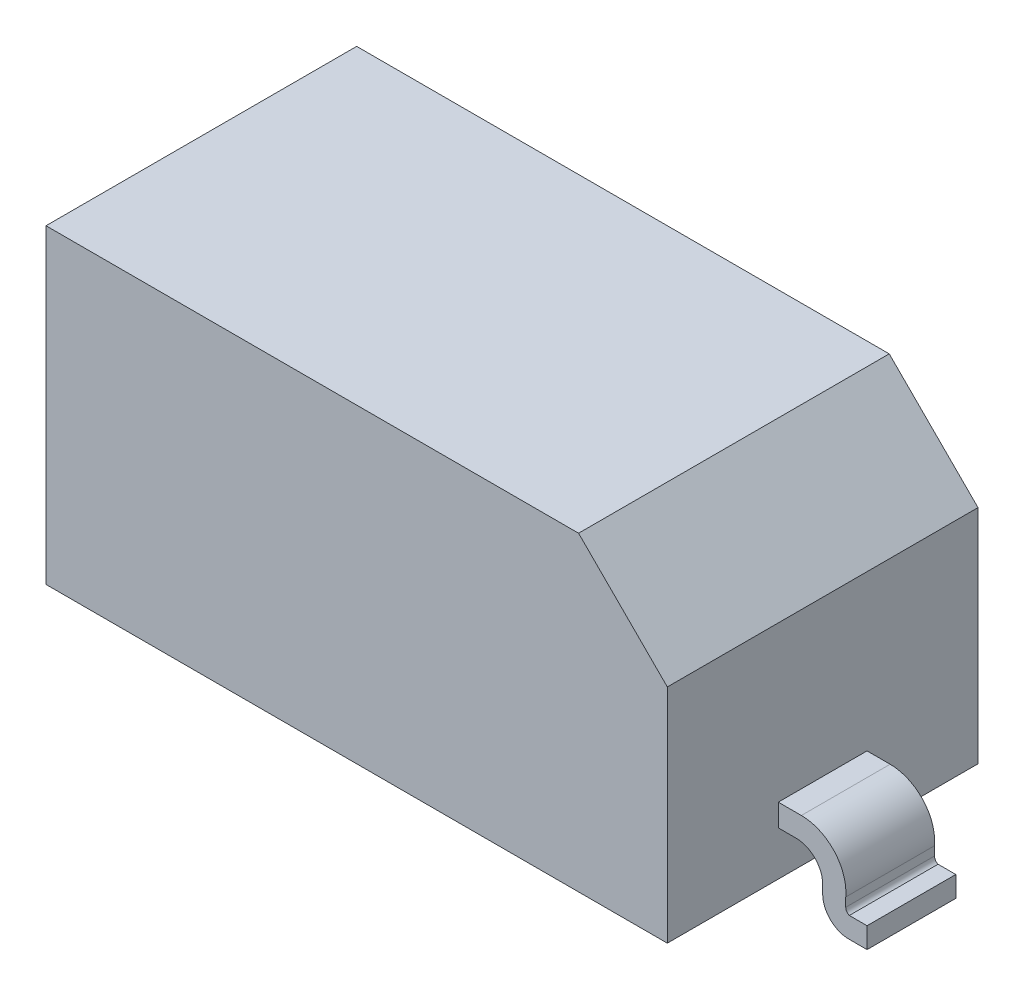
ISO-10303-21;
HEADER;
FILE_DESCRIPTION(('STEP AP214'),'2;1');
FILE_NAME('part.step','',(''),(''),'','','');
FILE_SCHEMA(('AUTOMOTIVE_DESIGN { 1 0 10303 214 1 1 1 1 }'));
ENDSEC;
DATA;
#1=APPLICATION_CONTEXT('core data for automotive mechanical design processes');
#2=APPLICATION_PROTOCOL_DEFINITION('international standard','automotive_design',2000,#1);
#3=PRODUCT_CONTEXT('',#1,'mechanical');
#4=PRODUCT('Part','Part','',(#3));
#5=PRODUCT_RELATED_PRODUCT_CATEGORY('part','',(#4));
#6=PRODUCT_DEFINITION_FORMATION('','',#4);
#7=PRODUCT_DEFINITION_CONTEXT('part definition',#1,'design');
#8=PRODUCT_DEFINITION('design','',#6,#7);
#9=PRODUCT_DEFINITION_SHAPE('','',#8);
#10=(LENGTH_UNIT() NAMED_UNIT(*) SI_UNIT(.MILLI.,.METRE.));
#11=(NAMED_UNIT(*) PLANE_ANGLE_UNIT() SI_UNIT($,.RADIAN.));
#12=(NAMED_UNIT(*) SI_UNIT($,.STERADIAN.) SOLID_ANGLE_UNIT());
#13=UNCERTAINTY_MEASURE_WITH_UNIT(LENGTH_MEASURE(1.E-05),#10,'distance_accuracy_value','');
#14=(GEOMETRIC_REPRESENTATION_CONTEXT(3) GLOBAL_UNCERTAINTY_ASSIGNED_CONTEXT((#13)) GLOBAL_UNIT_ASSIGNED_CONTEXT((#10,
#11,#12)) REPRESENTATION_CONTEXT('',''));
#15=CARTESIAN_POINT('',(0.,0.,0.));
#16=DIRECTION('',(0.,0.,1.));
#17=DIRECTION('',(1.,0.,0.));
#18=AXIS2_PLACEMENT_3D('',#15,#16,#17);
#19=CARTESIAN_POINT('',(-1.75,0.875,0.875));
#20=DIRECTION('',(1.,0.,0.));
#21=DIRECTION('',(0.,0.,-1.));
#22=AXIS2_PLACEMENT_3D('',#19,#20,#21);
#23=PLANE('',#22);
#24=DIRECTION('',(0.,-1.,0.));
#25=VECTOR('',#24,1.);
#26=CARTESIAN_POINT('',(-1.75,0.875,-0.875));
#27=LINE('',#26,#25);
#28=CARTESIAN_POINT('',(-1.75,0.875,-0.875));
#29=VERTEX_POINT('',#28);
#30=CARTESIAN_POINT('',(-1.75,-0.875,-0.875));
#31=VERTEX_POINT('',#30);
#32=EDGE_CURVE('E338',#29,#31,#27,.T.);
#33=ORIENTED_EDGE('',*,*,#32,.T.);
#34=DIRECTION('',(0.,0.,-1.));
#35=VECTOR('',#34,1.);
#36=CARTESIAN_POINT('',(-1.75,-0.875,0.875));
#37=LINE('',#36,#35);
#38=CARTESIAN_POINT('',(-1.75,-0.875,0.875));
#39=VERTEX_POINT('',#38);
#40=EDGE_CURVE('E11',#39,#31,#37,.T.);
#41=ORIENTED_EDGE('',*,*,#40,.F.);
#42=DIRECTION('',(0.,-1.,0.));
#43=VECTOR('',#42,1.);
#44=CARTESIAN_POINT('',(-1.75,0.875,0.875));
#45=LINE('',#44,#43);
#46=CARTESIAN_POINT('',(-1.75,0.875,0.875));
#47=VERTEX_POINT('',#46);
#48=EDGE_CURVE('E339',#47,#39,#45,.T.);
#49=ORIENTED_EDGE('',*,*,#48,.F.);
#50=DIRECTION('',(0.,0.,-1.));
#51=VECTOR('',#50,1.);
#52=CARTESIAN_POINT('',(-1.75,0.875,0.875));
#53=LINE('',#52,#51);
#54=EDGE_CURVE('E351',#47,#29,#53,.T.);
#55=ORIENTED_EDGE('',*,*,#54,.T.);
#56=EDGE_LOOP('',(#33,#41,#49,#55));
#57=FACE_BOUND('',#56,.T.);
#58=DIRECTION('',(0.,-1.,0.));
#59=VECTOR('',#58,1.);
#60=CARTESIAN_POINT('',(-1.75,-0.625,0.25));
#61=LINE('',#60,#59);
#62=CARTESIAN_POINT('',(-1.75,-0.49948491419278,0.25));
#63=VERTEX_POINT('',#62);
#64=CARTESIAN_POINT('',(-1.75,-0.625,0.25));
#65=VERTEX_POINT('',#64);
#66=EDGE_CURVE('E227',#63,#65,#61,.T.);
#67=ORIENTED_EDGE('',*,*,#66,.T.);
#68=DIRECTION('',(0.,0.,-1.));
#69=VECTOR('',#68,1.);
#70=CARTESIAN_POINT('',(-1.75,-0.625,0.25));
#71=LINE('',#70,#69);
#72=CARTESIAN_POINT('',(-1.75,-0.625,-0.25));
#73=VERTEX_POINT('',#72);
#74=EDGE_CURVE('E708',#65,#73,#71,.T.);
#75=ORIENTED_EDGE('',*,*,#74,.T.);
#76=DIRECTION('',(0.,-1.,0.));
#77=VECTOR('',#76,1.);
#78=CARTESIAN_POINT('',(-1.75,-0.625,-0.25));
#79=LINE('',#78,#77);
#80=CARTESIAN_POINT('',(-1.75,-0.499484914192779,-0.25));
#81=VERTEX_POINT('',#80);
#82=EDGE_CURVE('E248',#81,#73,#79,.T.);
#83=ORIENTED_EDGE('',*,*,#82,.F.);
#84=DIRECTION('',(0.,0.,-1.));
#85=VECTOR('',#84,1.);
#86=CARTESIAN_POINT('',(-1.75,-0.49948491419278,0.25));
#87=LINE('',#86,#85);
#88=EDGE_CURVE('E243',#63,#81,#87,.T.);
#89=ORIENTED_EDGE('',*,*,#88,.F.);
#90=EDGE_LOOP('',(#67,#75,#83,#89));
#91=FACE_BOUND('',#90,.T.);
#92=ADVANCED_FACE('F35',(#57,#91),#23,.F.);
#93=CARTESIAN_POINT('',(1.75,-0.874999999999999,0.875));
#94=DIRECTION('',(-1.,0.,0.));
#95=DIRECTION('',(0.,-1.,0.));
#96=AXIS2_PLACEMENT_3D('',#93,#94,#95);
#97=PLANE('',#96);
#98=DIRECTION('',(0.,1.,0.));
#99=VECTOR('',#98,1.);
#100=CARTESIAN_POINT('',(1.75,-0.874999999999999,-0.875));
#101=LINE('',#100,#99);
#102=CARTESIAN_POINT('',(1.75,-0.874999999999999,-0.875));
#103=VERTEX_POINT('',#102);
#104=CARTESIAN_POINT('',(1.75,0.375000000000001,-0.875));
#105=VERTEX_POINT('',#104);
#106=EDGE_CURVE('E356',#103,#105,#101,.T.);
#107=ORIENTED_EDGE('',*,*,#106,.T.);
#108=DIRECTION('',(0.,0.,-1.));
#109=VECTOR('',#108,1.);
#110=CARTESIAN_POINT('',(1.75,0.375000000000001,0.875));
#111=LINE('',#110,#109);
#112=CARTESIAN_POINT('',(1.75,0.375000000000001,0.875));
#113=VERTEX_POINT('',#112);
#114=EDGE_CURVE('E366',#113,#105,#111,.T.);
#115=ORIENTED_EDGE('',*,*,#114,.F.);
#116=DIRECTION('',(0.,1.,0.));
#117=VECTOR('',#116,1.);
#118=CARTESIAN_POINT('',(1.75,-0.874999999999999,0.875));
#119=LINE('',#118,#117);
#120=CARTESIAN_POINT('',(1.75,-0.874999999999999,0.875));
#121=VERTEX_POINT('',#120);
#122=EDGE_CURVE('E345',#121,#113,#119,.T.);
#123=ORIENTED_EDGE('',*,*,#122,.F.);
#124=DIRECTION('',(0.,0.,-1.));
#125=VECTOR('',#124,1.);
#126=CARTESIAN_POINT('',(1.75,-0.874999999999999,0.875));
#127=LINE('',#126,#125);
#128=EDGE_CURVE('E42',#121,#103,#127,.T.);
#129=ORIENTED_EDGE('',*,*,#128,.T.);
#130=EDGE_LOOP('',(#107,#115,#123,#129));
#131=FACE_BOUND('',#130,.T.);
#132=DIRECTION('',(0.,-1.,0.));
#133=VECTOR('',#132,1.);
#134=CARTESIAN_POINT('',(1.75,-0.625,0.25));
#135=LINE('',#134,#133);
#136=CARTESIAN_POINT('',(1.75,-0.49948491419278,0.25));
#137=VERTEX_POINT('',#136);
#138=CARTESIAN_POINT('',(1.75,-0.625,0.25));
#139=VERTEX_POINT('',#138);
#140=EDGE_CURVE('E258',#137,#139,#135,.T.);
#141=ORIENTED_EDGE('',*,*,#140,.F.);
#142=DIRECTION('',(0.,0.,-1.));
#143=VECTOR('',#142,1.);
#144=CARTESIAN_POINT('',(1.75,-0.49948491419278,0.25));
#145=LINE('',#144,#143);
#146=CARTESIAN_POINT('',(1.75,-0.49948491419278,-0.25));
#147=VERTEX_POINT('',#146);
#148=EDGE_CURVE('E283',#137,#147,#145,.T.);
#149=ORIENTED_EDGE('',*,*,#148,.T.);
#150=DIRECTION('',(0.,-1.,0.));
#151=VECTOR('',#150,1.);
#152=CARTESIAN_POINT('',(1.75,-0.625,-0.25));
#153=LINE('',#152,#151);
#154=CARTESIAN_POINT('',(1.75,-0.625,-0.25));
#155=VERTEX_POINT('',#154);
#156=EDGE_CURVE('E249',#147,#155,#153,.T.);
#157=ORIENTED_EDGE('',*,*,#156,.T.);
#158=DIRECTION('',(0.,0.,-1.));
#159=VECTOR('',#158,1.);
#160=CARTESIAN_POINT('',(1.75,-0.625,0.25));
#161=LINE('',#160,#159);
#162=EDGE_CURVE('E57',#139,#155,#161,.T.);
#163=ORIENTED_EDGE('',*,*,#162,.F.);
#164=EDGE_LOOP('',(#141,#149,#157,#163));
#165=FACE_BOUND('',#164,.T.);
#166=ADVANCED_FACE('F373',(#131,#165),#97,.F.);
#167=CARTESIAN_POINT('',(-1.75,-0.875,0.875));
#168=DIRECTION('',(0.,1.,0.));
#169=DIRECTION('',(-1.,0.,0.));
#170=AXIS2_PLACEMENT_3D('',#167,#168,#169);
#171=PLANE('',#170);
#172=DIRECTION('',(1.,0.,0.));
#173=VECTOR('',#172,1.);
#174=CARTESIAN_POINT('',(-1.75,-0.875,-0.875));
#175=LINE('',#174,#173);
#176=EDGE_CURVE('E354',#31,#103,#175,.T.);
#177=ORIENTED_EDGE('',*,*,#176,.T.);
#178=ORIENTED_EDGE('',*,*,#128,.F.);
#179=DIRECTION('',(1.,0.,0.));
#180=VECTOR('',#179,1.);
#181=CARTESIAN_POINT('',(-1.75,-0.875,0.875));
#182=LINE('',#181,#180);
#183=EDGE_CURVE('E342',#39,#121,#182,.T.);
#184=ORIENTED_EDGE('',*,*,#183,.F.);
#185=ORIENTED_EDGE('',*,*,#40,.T.);
#186=EDGE_LOOP('',(#177,#178,#184,#185));
#187=FACE_BOUND('',#186,.T.);
#188=ADVANCED_FACE('F394',(#187),#171,.F.);
#189=CARTESIAN_POINT('',(1.75,0.375000000000001,0.875));
#190=DIRECTION('',(-0.707106781186548,-0.707106781186547,0.));
#191=DIRECTION('',(0.707106781186547,-0.707106781186548,0.));
#192=AXIS2_PLACEMENT_3D('',#189,#190,#191);
#193=PLANE('',#192);
#194=DIRECTION('',(-0.707106781186547,0.707106781186548,0.));
#195=VECTOR('',#194,1.);
#196=CARTESIAN_POINT('',(1.75,0.375000000000001,-0.875));
#197=LINE('',#196,#195);
#198=CARTESIAN_POINT('',(1.25,0.875,-0.875));
#199=VERTEX_POINT('',#198);
#200=EDGE_CURVE('E358',#105,#199,#197,.T.);
#201=ORIENTED_EDGE('',*,*,#200,.T.);
#202=DIRECTION('',(0.,0.,-1.));
#203=VECTOR('',#202,1.);
#204=CARTESIAN_POINT('',(1.25,0.875,0.875));
#205=LINE('',#204,#203);
#206=CARTESIAN_POINT('',(1.25,0.875,0.875));
#207=VERTEX_POINT('',#206);
#208=EDGE_CURVE('E363',#207,#199,#205,.T.);
#209=ORIENTED_EDGE('',*,*,#208,.F.);
#210=DIRECTION('',(-0.707106781186547,0.707106781186548,0.));
#211=VECTOR('',#210,1.);
#212=CARTESIAN_POINT('',(1.75,0.375000000000001,0.875));
#213=LINE('',#212,#211);
#214=EDGE_CURVE('E347',#113,#207,#213,.T.);
#215=ORIENTED_EDGE('',*,*,#214,.F.);
#216=ORIENTED_EDGE('',*,*,#114,.T.);
#217=EDGE_LOOP('',(#201,#209,#215,#216));
#218=FACE_BOUND('',#217,.T.);
#219=ADVANCED_FACE('F384',(#218),#193,.F.);
#220=CARTESIAN_POINT('',(1.25,0.875,0.875));
#221=DIRECTION('',(0.,-1.,0.));
#222=DIRECTION('',(0.,0.,-1.));
#223=AXIS2_PLACEMENT_3D('',#220,#221,#222);
#224=PLANE('',#223);
#225=DIRECTION('',(-1.,0.,0.));
#226=VECTOR('',#225,1.);
#227=CARTESIAN_POINT('',(1.25,0.875,-0.875));
#228=LINE('',#227,#226);
#229=EDGE_CURVE('E343',#199,#29,#228,.T.);
#230=ORIENTED_EDGE('',*,*,#229,.T.);
#231=ORIENTED_EDGE('',*,*,#54,.F.);
#232=DIRECTION('',(-1.,0.,0.));
#233=VECTOR('',#232,1.);
#234=CARTESIAN_POINT('',(1.25,0.875,0.875));
#235=LINE('',#234,#233);
#236=EDGE_CURVE('E349',#207,#47,#235,.T.);
#237=ORIENTED_EDGE('',*,*,#236,.F.);
#238=ORIENTED_EDGE('',*,*,#208,.T.);
#239=EDGE_LOOP('',(#230,#231,#237,#238));
#240=FACE_BOUND('',#239,.T.);
#241=ADVANCED_FACE('F388',(#240),#224,.F.);
#242=CARTESIAN_POINT('',(-1.75,0.875,0.875));
#243=DIRECTION('',(0.,0.,-1.));
#244=DIRECTION('',(-1.,0.,0.));
#245=AXIS2_PLACEMENT_3D('',#242,#243,#244);
#246=PLANE('',#245);
#247=ORIENTED_EDGE('',*,*,#48,.T.);
#248=ORIENTED_EDGE('',*,*,#183,.T.);
#249=ORIENTED_EDGE('',*,*,#122,.T.);
#250=ORIENTED_EDGE('',*,*,#214,.T.);
#251=ORIENTED_EDGE('',*,*,#236,.T.);
#252=EDGE_LOOP('',(#247,#248,#249,#250,#251));
#253=FACE_BOUND('',#252,.T.);
#254=ADVANCED_FACE('F392',(#253),#246,.F.);
#255=CARTESIAN_POINT('',(-1.75,0.875,-0.875));
#256=DIRECTION('',(0.,0.,-1.));
#257=DIRECTION('',(-1.,0.,0.));
#258=AXIS2_PLACEMENT_3D('',#255,#256,#257);
#259=PLANE('',#258);
#260=ORIENTED_EDGE('',*,*,#32,.F.);
#261=ORIENTED_EDGE('',*,*,#229,.F.);
#262=ORIENTED_EDGE('',*,*,#200,.F.);
#263=ORIENTED_EDGE('',*,*,#106,.F.);
#264=ORIENTED_EDGE('',*,*,#176,.F.);
#265=EDGE_LOOP('',(#260,#261,#262,#263,#264));
#266=FACE_BOUND('',#265,.T.);
#267=ADVANCED_FACE('F380',(#266),#259,.T.);
#268=CARTESIAN_POINT('',(1.75,-0.625,0.25));
#269=DIRECTION('',(0.,1.,0.));
#270=DIRECTION('',(0.,0.,1.));
#271=AXIS2_PLACEMENT_3D('',#268,#269,#270);
#272=PLANE('',#271);
#273=DIRECTION('',(1.,0.,0.));
#274=VECTOR('',#273,1.);
#275=CARTESIAN_POINT('',(1.75,-0.625,-0.25));
#276=LINE('',#275,#274);
#277=CARTESIAN_POINT('',(1.85,-0.625,-0.25));
#278=VERTEX_POINT('',#277);
#279=EDGE_CURVE('E252',#155,#278,#276,.T.);
#280=ORIENTED_EDGE('',*,*,#279,.T.);
#281=DIRECTION('',(0.,0.,-1.));
#282=VECTOR('',#281,1.);
#283=CARTESIAN_POINT('',(1.85,-0.625,0.25));
#284=LINE('',#283,#282);
#285=CARTESIAN_POINT('',(1.85,-0.625,0.25));
#286=VERTEX_POINT('',#285);
#287=EDGE_CURVE('E334',#286,#278,#284,.T.);
#288=ORIENTED_EDGE('',*,*,#287,.F.);
#289=DIRECTION('',(1.,0.,0.));
#290=VECTOR('',#289,1.);
#291=CARTESIAN_POINT('',(1.75,-0.625,0.25));
#292=LINE('',#291,#290);
#293=EDGE_CURVE('E261',#139,#286,#292,.T.);
#294=ORIENTED_EDGE('',*,*,#293,.F.);
#295=ORIENTED_EDGE('',*,*,#162,.T.);
#296=EDGE_LOOP('',(#280,#288,#294,#295));
#297=FACE_BOUND('',#296,.T.);
#298=ADVANCED_FACE('F411',(#297),#272,.F.);
#299=CARTESIAN_POINT('',(1.85,-0.77503124674547,0.25));
#300=DIRECTION('',(0.,0.,-1.));
#301=DIRECTION('',(-1.,0.,0.));
#302=AXIS2_PLACEMENT_3D('',#299,#300,#301);
#303=CYLINDRICAL_SURFACE('',#302,0.15003124674547);
#304=CARTESIAN_POINT('',(1.85,-0.77503124674547,-0.25));
#305=DIRECTION('',(0.,0.,-1.));
#306=DIRECTION('',(-1.,0.,0.));
#307=AXIS2_PLACEMENT_3D('',#304,#305,#306);
#308=CIRCLE('',#307,0.15003124674547);
#309=CARTESIAN_POINT('',(2.,-0.771969384566991,-0.25));
#310=VERTEX_POINT('',#309);
#311=EDGE_CURVE('E286',#278,#310,#308,.T.);
#312=ORIENTED_EDGE('',*,*,#311,.T.);
#313=DIRECTION('',(0.,0.,-1.));
#314=VECTOR('',#313,1.);
#315=CARTESIAN_POINT('',(2.,-0.771969384566991,0.25));
#316=LINE('',#315,#314);
#317=CARTESIAN_POINT('',(2.,-0.771969384566991,0.25));
#318=VERTEX_POINT('',#317);
#319=EDGE_CURVE('E331',#318,#310,#316,.T.);
#320=ORIENTED_EDGE('',*,*,#319,.F.);
#321=CARTESIAN_POINT('',(1.85,-0.77503124674547,0.25));
#322=DIRECTION('',(0.,0.,-1.));
#323=DIRECTION('',(-1.,0.,0.));
#324=AXIS2_PLACEMENT_3D('',#321,#322,#323);
#325=CIRCLE('',#324,0.15003124674547);
#326=EDGE_CURVE('E264',#286,#318,#325,.T.);
#327=ORIENTED_EDGE('',*,*,#326,.F.);
#328=ORIENTED_EDGE('',*,*,#287,.T.);
#329=EDGE_LOOP('',(#312,#320,#327,#328));
#330=FACE_BOUND('',#329,.T.);
#331=ADVANCED_FACE('F416',(#330),#303,.F.);
#332=CARTESIAN_POINT('',(2.,-0.771969384566991,0.25));
#333=DIRECTION('',(1.,0.,0.));
#334=DIRECTION('',(0.,0.,-1.));
#335=AXIS2_PLACEMENT_3D('',#332,#333,#334);
#336=PLANE('',#335);
#337=DIRECTION('',(0.,-1.,0.));
#338=VECTOR('',#337,1.);
#339=CARTESIAN_POINT('',(2.,-0.771969384566991,-0.25));
#340=LINE('',#339,#338);
#341=CARTESIAN_POINT('',(2.,-0.821969384566991,-0.25));
#342=VERTEX_POINT('',#341);
#343=EDGE_CURVE('E288',#310,#342,#340,.T.);
#344=ORIENTED_EDGE('',*,*,#343,.T.);
#345=DIRECTION('',(0.,0.,-1.));
#346=VECTOR('',#345,1.);
#347=CARTESIAN_POINT('',(2.,-0.821969384566991,0.25));
#348=LINE('',#347,#346);
#349=CARTESIAN_POINT('',(2.,-0.821969384566991,0.25));
#350=VERTEX_POINT('',#349);
#351=EDGE_CURVE('E328',#350,#342,#348,.T.);
#352=ORIENTED_EDGE('',*,*,#351,.F.);
#353=DIRECTION('',(0.,-1.,0.));
#354=VECTOR('',#353,1.);
#355=CARTESIAN_POINT('',(2.,-0.771969384566991,0.25));
#356=LINE('',#355,#354);
#357=EDGE_CURVE('E266',#318,#350,#356,.T.);
#358=ORIENTED_EDGE('',*,*,#357,.F.);
#359=ORIENTED_EDGE('',*,*,#319,.T.);
#360=EDGE_LOOP('',(#344,#352,#358,#359));
#361=FACE_BOUND('',#360,.T.);
#362=ADVANCED_FACE('F419',(#361),#336,.F.);
#363=CARTESIAN_POINT('',(2.147,-0.821969384566991,0.25));
#364=DIRECTION('',(0.,0.,-1.));
#365=DIRECTION('',(-1.,0.,0.));
#366=AXIS2_PLACEMENT_3D('',#363,#364,#365);
#367=CYLINDRICAL_SURFACE('',#366,0.147);
#368=CARTESIAN_POINT('',(2.147,-0.821969384566991,-0.25));
#369=DIRECTION('',(0.,0.,1.));
#370=DIRECTION('',(1.,0.,0.));
#371=AXIS2_PLACEMENT_3D('',#368,#369,#370);
#372=CIRCLE('',#371,0.147);
#373=CARTESIAN_POINT('',(2.15,-0.968938769133981,-0.25));
#374=VERTEX_POINT('',#373);
#375=EDGE_CURVE('E290',#342,#374,#372,.T.);
#376=ORIENTED_EDGE('',*,*,#375,.T.);
#377=DIRECTION('',(0.,0.,-1.));
#378=VECTOR('',#377,1.);
#379=CARTESIAN_POINT('',(2.15,-0.968938769133981,0.25));
#380=LINE('',#379,#378);
#381=CARTESIAN_POINT('',(2.15,-0.968938769133981,0.25));
#382=VERTEX_POINT('',#381);
#383=EDGE_CURVE('E325',#382,#374,#380,.T.);
#384=ORIENTED_EDGE('',*,*,#383,.F.);
#385=CARTESIAN_POINT('',(2.147,-0.821969384566991,0.25));
#386=DIRECTION('',(0.,0.,1.));
#387=DIRECTION('',(1.,0.,0.));
#388=AXIS2_PLACEMENT_3D('',#385,#386,#387);
#389=CIRCLE('',#388,0.147);
#390=EDGE_CURVE('E268',#350,#382,#389,.T.);
#391=ORIENTED_EDGE('',*,*,#390,.F.);
#392=ORIENTED_EDGE('',*,*,#351,.T.);
#393=EDGE_LOOP('',(#376,#384,#391,#392));
#394=FACE_BOUND('',#393,.T.);
#395=ADVANCED_FACE('F423',(#394),#367,.T.);
#396=CARTESIAN_POINT('',(2.25,-0.968938769133981,0.25));
#397=DIRECTION('',(0.,1.,0.));
#398=DIRECTION('',(0.,0.,1.));
#399=AXIS2_PLACEMENT_3D('',#396,#397,#398);
#400=PLANE('',#399);
#401=DIRECTION('',(1.,0.,0.));
#402=VECTOR('',#401,1.);
#403=CARTESIAN_POINT('',(2.25,-0.968938769133981,-0.25));
#404=LINE('',#403,#402);
#405=CARTESIAN_POINT('',(2.25,-0.968938769133981,-0.25));
#406=VERTEX_POINT('',#405);
#407=EDGE_CURVE('E292',#374,#406,#404,.T.);
#408=ORIENTED_EDGE('',*,*,#407,.T.);
#409=DIRECTION('',(0.,0.,-1.));
#410=VECTOR('',#409,1.);
#411=CARTESIAN_POINT('',(2.25,-0.968938769133981,0.25));
#412=LINE('',#411,#410);
#413=CARTESIAN_POINT('',(2.25,-0.968938769133981,0.25));
#414=VERTEX_POINT('',#413);
#415=EDGE_CURVE('E322',#414,#406,#412,.T.);
#416=ORIENTED_EDGE('',*,*,#415,.F.);
#417=DIRECTION('',(1.,0.,0.));
#418=VECTOR('',#417,1.);
#419=CARTESIAN_POINT('',(2.25,-0.968938769133981,0.25));
#420=LINE('',#419,#418);
#421=EDGE_CURVE('E270',#382,#414,#420,.T.);
#422=ORIENTED_EDGE('',*,*,#421,.F.);
#423=ORIENTED_EDGE('',*,*,#383,.T.);
#424=EDGE_LOOP('',(#408,#416,#422,#423));
#425=FACE_BOUND('',#424,.T.);
#426=ADVANCED_FACE('F427',(#425),#400,.F.);
#427=CARTESIAN_POINT('',(2.25,-0.852248548132497,0.25));
#428=DIRECTION('',(-1.,0.,0.));
#429=DIRECTION('',(0.,0.,1.));
#430=AXIS2_PLACEMENT_3D('',#427,#428,#429);
#431=PLANE('',#430);
#432=DIRECTION('',(0.,1.,0.));
#433=VECTOR('',#432,1.);
#434=CARTESIAN_POINT('',(2.25,-0.852248548132497,-0.25));
#435=LINE('',#434,#433);
#436=CARTESIAN_POINT('',(2.25,-0.852248548132497,-0.25));
#437=VERTEX_POINT('',#436);
#438=EDGE_CURVE('E294',#406,#437,#435,.T.);
#439=ORIENTED_EDGE('',*,*,#438,.T.);
#440=DIRECTION('',(0.,0.,-1.));
#441=VECTOR('',#440,1.);
#442=CARTESIAN_POINT('',(2.25,-0.852248548132497,0.25));
#443=LINE('',#442,#441);
#444=CARTESIAN_POINT('',(2.25,-0.852248548132497,0.25));
#445=VERTEX_POINT('',#444);
#446=EDGE_CURVE('E319',#445,#437,#443,.T.);
#447=ORIENTED_EDGE('',*,*,#446,.F.);
#448=DIRECTION('',(0.,1.,0.));
#449=VECTOR('',#448,1.);
#450=CARTESIAN_POINT('',(2.25,-0.852248548132497,0.25));
#451=LINE('',#450,#449);
#452=EDGE_CURVE('E272',#414,#445,#451,.T.);
#453=ORIENTED_EDGE('',*,*,#452,.F.);
#454=ORIENTED_EDGE('',*,*,#415,.T.);
#455=EDGE_LOOP('',(#439,#447,#453,#454));
#456=FACE_BOUND('',#455,.T.);
#457=ADVANCED_FACE('F431',(#456),#431,.F.);
#458=CARTESIAN_POINT('',(2.15,-0.852248548132497,0.25));
#459=DIRECTION('',(0.,-1.,0.));
#460=DIRECTION('',(0.,0.,-1.));
#461=AXIS2_PLACEMENT_3D('',#458,#459,#460);
#462=PLANE('',#461);
#463=DIRECTION('',(-1.,0.,0.));
#464=VECTOR('',#463,1.);
#465=CARTESIAN_POINT('',(2.15,-0.852248548132497,-0.25));
#466=LINE('',#465,#464);
#467=CARTESIAN_POINT('',(2.15,-0.852248548132497,-0.25));
#468=VERTEX_POINT('',#467);
#469=EDGE_CURVE('E296',#437,#468,#466,.T.);
#470=ORIENTED_EDGE('',*,*,#469,.T.);
#471=DIRECTION('',(0.,0.,-1.));
#472=VECTOR('',#471,1.);
#473=CARTESIAN_POINT('',(2.15,-0.852248548132497,0.25));
#474=LINE('',#473,#472);
#475=CARTESIAN_POINT('',(2.15,-0.852248548132497,0.25));
#476=VERTEX_POINT('',#475);
#477=EDGE_CURVE('E316',#476,#468,#474,.T.);
#478=ORIENTED_EDGE('',*,*,#477,.F.);
#479=DIRECTION('',(-1.,0.,0.));
#480=VECTOR('',#479,1.);
#481=CARTESIAN_POINT('',(2.15,-0.852248548132497,0.25));
#482=LINE('',#481,#480);
#483=EDGE_CURVE('E274',#445,#476,#482,.T.);
#484=ORIENTED_EDGE('',*,*,#483,.F.);
#485=ORIENTED_EDGE('',*,*,#446,.T.);
#486=EDGE_LOOP('',(#470,#478,#484,#485));
#487=FACE_BOUND('',#486,.T.);
#488=ADVANCED_FACE('F435',(#487),#462,.F.);
#489=CARTESIAN_POINT('',(2.1625,-0.822248548132497,0.25));
#490=DIRECTION('',(0.,0.,-1.));
#491=DIRECTION('',(-1.,0.,0.));
#492=AXIS2_PLACEMENT_3D('',#489,#490,#491);
#493=CYLINDRICAL_SURFACE('',#492,0.0324999999999995);
#494=CARTESIAN_POINT('',(2.1625,-0.822248548132497,-0.25));
#495=DIRECTION('',(0.,0.,-1.));
#496=DIRECTION('',(1.,0.,0.));
#497=AXIS2_PLACEMENT_3D('',#494,#495,#496);
#498=CIRCLE('',#497,0.0324999999999995);
#499=CARTESIAN_POINT('',(2.13,-0.822248548132497,-0.25));
#500=VERTEX_POINT('',#499);
#501=EDGE_CURVE('E298',#468,#500,#498,.T.);
#502=ORIENTED_EDGE('',*,*,#501,.T.);
#503=DIRECTION('',(0.,0.,-1.));
#504=VECTOR('',#503,1.);
#505=CARTESIAN_POINT('',(2.13,-0.822248548132497,0.25));
#506=LINE('',#505,#504);
#507=CARTESIAN_POINT('',(2.13,-0.822248548132497,0.25));
#508=VERTEX_POINT('',#507);
#509=EDGE_CURVE('E313',#508,#500,#506,.T.);
#510=ORIENTED_EDGE('',*,*,#509,.F.);
#511=CARTESIAN_POINT('',(2.1625,-0.822248548132497,0.25));
#512=DIRECTION('',(0.,0.,-1.));
#513=DIRECTION('',(1.,0.,0.));
#514=AXIS2_PLACEMENT_3D('',#511,#512,#513);
#515=CIRCLE('',#514,0.0324999999999995);
#516=EDGE_CURVE('E276',#476,#508,#515,.T.);
#517=ORIENTED_EDGE('',*,*,#516,.F.);
#518=ORIENTED_EDGE('',*,*,#477,.T.);
#519=EDGE_LOOP('',(#502,#510,#517,#518));
#520=FACE_BOUND('',#519,.T.);
#521=ADVANCED_FACE('F439',(#520),#493,.F.);
#522=CARTESIAN_POINT('',(2.13,-0.772248548132497,0.25));
#523=DIRECTION('',(-1.,0.,0.));
#524=DIRECTION('',(0.,0.,1.));
#525=AXIS2_PLACEMENT_3D('',#522,#523,#524);
#526=PLANE('',#525);
#527=DIRECTION('',(0.,1.,0.));
#528=VECTOR('',#527,1.);
#529=CARTESIAN_POINT('',(2.13,-0.772248548132497,-0.25));
#530=LINE('',#529,#528);
#531=CARTESIAN_POINT('',(2.13,-0.772248548132497,-0.25));
#532=VERTEX_POINT('',#531);
#533=EDGE_CURVE('E300',#500,#532,#530,.T.);
#534=ORIENTED_EDGE('',*,*,#533,.T.);
#535=DIRECTION('',(0.,0.,-1.));
#536=VECTOR('',#535,1.);
#537=CARTESIAN_POINT('',(2.13,-0.772248548132497,0.25));
#538=LINE('',#537,#536);
#539=CARTESIAN_POINT('',(2.13,-0.772248548132497,0.25));
#540=VERTEX_POINT('',#539);
#541=EDGE_CURVE('E310',#540,#532,#538,.T.);
#542=ORIENTED_EDGE('',*,*,#541,.F.);
#543=DIRECTION('',(0.,1.,0.));
#544=VECTOR('',#543,1.);
#545=CARTESIAN_POINT('',(2.13,-0.772248548132497,0.25));
#546=LINE('',#545,#544);
#547=EDGE_CURVE('E278',#508,#540,#546,.T.);
#548=ORIENTED_EDGE('',*,*,#547,.F.);
#549=ORIENTED_EDGE('',*,*,#509,.T.);
#550=EDGE_LOOP('',(#534,#542,#548,#549));
#551=FACE_BOUND('',#550,.T.);
#552=ADVANCED_FACE('F443',(#551),#526,.F.);
#553=CARTESIAN_POINT('',(1.88,-0.75043478977307,0.25));
#554=DIRECTION('',(0.,0.,-1.));
#555=DIRECTION('',(-1.,0.,0.));
#556=AXIS2_PLACEMENT_3D('',#553,#554,#555);
#557=CYLINDRICAL_SURFACE('',#556,0.250949875580291);
#558=CARTESIAN_POINT('',(1.88,-0.75043478977307,-0.25));
#559=DIRECTION('',(0.,0.,1.));
#560=DIRECTION('',(-1.,0.,0.));
#561=AXIS2_PLACEMENT_3D('',#558,#559,#560);
#562=CIRCLE('',#561,0.250949875580291);
#563=CARTESIAN_POINT('',(1.88,-0.49948491419278,-0.25));
#564=VERTEX_POINT('',#563);
#565=EDGE_CURVE('E302',#532,#564,#562,.T.);
#566=ORIENTED_EDGE('',*,*,#565,.T.);
#567=DIRECTION('',(0.,0.,-1.));
#568=VECTOR('',#567,1.);
#569=CARTESIAN_POINT('',(1.88,-0.49948491419278,0.25));
#570=LINE('',#569,#568);
#571=CARTESIAN_POINT('',(1.88,-0.49948491419278,0.25));
#572=VERTEX_POINT('',#571);
#573=EDGE_CURVE('E307',#572,#564,#570,.T.);
#574=ORIENTED_EDGE('',*,*,#573,.F.);
#575=CARTESIAN_POINT('',(1.88,-0.75043478977307,0.25));
#576=DIRECTION('',(0.,0.,1.));
#577=DIRECTION('',(-1.,0.,0.));
#578=AXIS2_PLACEMENT_3D('',#575,#576,#577);
#579=CIRCLE('',#578,0.250949875580291);
#580=EDGE_CURVE('E280',#540,#572,#579,.T.);
#581=ORIENTED_EDGE('',*,*,#580,.F.);
#582=ORIENTED_EDGE('',*,*,#541,.T.);
#583=EDGE_LOOP('',(#566,#574,#581,#582));
#584=FACE_BOUND('',#583,.T.);
#585=ADVANCED_FACE('F447',(#584),#557,.T.);
#586=CARTESIAN_POINT('',(1.75,-0.49948491419278,0.25));
#587=DIRECTION('',(0.,-1.,0.));
#588=DIRECTION('',(0.,0.,-1.));
#589=AXIS2_PLACEMENT_3D('',#586,#587,#588);
#590=PLANE('',#589);
#591=DIRECTION('',(-1.,0.,0.));
#592=VECTOR('',#591,1.);
#593=CARTESIAN_POINT('',(1.75,-0.49948491419278,-0.25));
#594=LINE('',#593,#592);
#595=EDGE_CURVE('E262',#564,#147,#594,.T.);
#596=ORIENTED_EDGE('',*,*,#595,.T.);
#597=ORIENTED_EDGE('',*,*,#148,.F.);
#598=DIRECTION('',(-1.,0.,0.));
#599=VECTOR('',#598,1.);
#600=CARTESIAN_POINT('',(1.75,-0.49948491419278,0.25));
#601=LINE('',#600,#599);
#602=EDGE_CURVE('E282',#572,#137,#601,.T.);
#603=ORIENTED_EDGE('',*,*,#602,.F.);
#604=ORIENTED_EDGE('',*,*,#573,.T.);
#605=EDGE_LOOP('',(#596,#597,#603,#604));
#606=FACE_BOUND('',#605,.T.);
#607=ADVANCED_FACE('F451',(#606),#590,.F.);
#608=CARTESIAN_POINT('',(1.88,-0.75043478977307,0.25));
#609=DIRECTION('',(0.,0.,-1.));
#610=DIRECTION('',(-1.,0.,0.));
#611=AXIS2_PLACEMENT_3D('',#608,#609,#610);
#612=PLANE('',#611);
#613=ORIENTED_EDGE('',*,*,#140,.T.);
#614=ORIENTED_EDGE('',*,*,#293,.T.);
#615=ORIENTED_EDGE('',*,*,#326,.T.);
#616=ORIENTED_EDGE('',*,*,#357,.T.);
#617=ORIENTED_EDGE('',*,*,#390,.T.);
#618=ORIENTED_EDGE('',*,*,#421,.T.);
#619=ORIENTED_EDGE('',*,*,#452,.T.);
#620=ORIENTED_EDGE('',*,*,#483,.T.);
#621=ORIENTED_EDGE('',*,*,#516,.T.);
#622=ORIENTED_EDGE('',*,*,#547,.T.);
#623=ORIENTED_EDGE('',*,*,#580,.T.);
#624=ORIENTED_EDGE('',*,*,#602,.T.);
#625=EDGE_LOOP('',(#613,#614,#615,#616,#617,#618,#619,#620,#621,#622,#623,#624));
#626=FACE_BOUND('',#625,.T.);
#627=ADVANCED_FACE('F455',(#626),#612,.F.);
#628=CARTESIAN_POINT('',(1.88,-0.75043478977307,-0.25));
#629=DIRECTION('',(0.,0.,-1.));
#630=DIRECTION('',(-1.,0.,0.));
#631=AXIS2_PLACEMENT_3D('',#628,#629,#630);
#632=PLANE('',#631);
#633=ORIENTED_EDGE('',*,*,#156,.F.);
#634=ORIENTED_EDGE('',*,*,#595,.F.);
#635=ORIENTED_EDGE('',*,*,#565,.F.);
#636=ORIENTED_EDGE('',*,*,#533,.F.);
#637=ORIENTED_EDGE('',*,*,#501,.F.);
#638=ORIENTED_EDGE('',*,*,#469,.F.);
#639=ORIENTED_EDGE('',*,*,#438,.F.);
#640=ORIENTED_EDGE('',*,*,#407,.F.);
#641=ORIENTED_EDGE('',*,*,#375,.F.);
#642=ORIENTED_EDGE('',*,*,#343,.F.);
#643=ORIENTED_EDGE('',*,*,#311,.F.);
#644=ORIENTED_EDGE('',*,*,#279,.F.);
#645=EDGE_LOOP('',(#633,#634,#635,#636,#637,#638,#639,#640,#641,#642,#643,#644));
#646=FACE_BOUND('',#645,.T.);
#647=ADVANCED_FACE('F457',(#646),#632,.T.);
#648=CARTESIAN_POINT('',(-1.75,-0.49948491419278,0.25));
#649=DIRECTION('',(0.,1.,0.));
#650=DIRECTION('',(0.,0.,1.));
#651=AXIS2_PLACEMENT_3D('',#648,#649,#650);
#652=PLANE('',#651);
#653=DIRECTION('',(1.,0.,0.));
#654=VECTOR('',#653,1.);
#655=CARTESIAN_POINT('',(-1.75,-0.49948491419278,-0.25));
#656=LINE('',#655,#654);
#657=CARTESIAN_POINT('',(-1.88,-0.49948491419278,-0.25));
#658=VERTEX_POINT('',#657);
#659=EDGE_CURVE('E49',#658,#81,#656,.T.);
#660=ORIENTED_EDGE('',*,*,#659,.F.);
#661=DIRECTION('',(0.,0.,-1.));
#662=VECTOR('',#661,1.);
#663=CARTESIAN_POINT('',(-1.88,-0.49948491419278,0.25));
#664=LINE('',#663,#662);
#665=CARTESIAN_POINT('',(-1.88,-0.49948491419278,0.25));
#666=VERTEX_POINT('',#665);
#667=EDGE_CURVE('E245',#666,#658,#664,.T.);
#668=ORIENTED_EDGE('',*,*,#667,.F.);
#669=DIRECTION('',(1.,0.,0.));
#670=VECTOR('',#669,1.);
#671=CARTESIAN_POINT('',(-1.75,-0.49948491419278,0.25));
#672=LINE('',#671,#670);
#673=EDGE_CURVE('E231',#666,#63,#672,.T.);
#674=ORIENTED_EDGE('',*,*,#673,.T.);
#675=ORIENTED_EDGE('',*,*,#88,.T.);
#676=EDGE_LOOP('',(#660,#668,#674,#675));
#677=FACE_BOUND('',#676,.T.);
#678=ADVANCED_FACE('F242',(#677),#652,.T.);
#679=CARTESIAN_POINT('',(-1.88,-0.75043478977307,0.25));
#680=DIRECTION('',(0.,0.,-1.));
#681=DIRECTION('',(-1.,0.,0.));
#682=AXIS2_PLACEMENT_3D('',#679,#680,#681);
#683=CYLINDRICAL_SURFACE('',#682,0.250949875580291);
#684=CARTESIAN_POINT('',(-1.88,-0.75043478977307,-0.25));
#685=DIRECTION('',(0.,0.,-1.));
#686=DIRECTION('',(1.,0.,0.));
#687=AXIS2_PLACEMENT_3D('',#684,#685,#686);
#688=CIRCLE('',#687,0.250949875580291);
#689=CARTESIAN_POINT('',(-2.13,-0.772248548132497,-0.25));
#690=VERTEX_POINT('',#689);
#691=EDGE_CURVE('E740',#690,#658,#688,.T.);
#692=ORIENTED_EDGE('',*,*,#691,.F.);
#693=DIRECTION('',(0.,0.,-1.));
#694=VECTOR('',#693,1.);
#695=CARTESIAN_POINT('',(-2.13,-0.772248548132497,0.25));
#696=LINE('',#695,#694);
#697=CARTESIAN_POINT('',(-2.13,-0.772248548132497,0.25));
#698=VERTEX_POINT('',#697);
#699=EDGE_CURVE('E254',#698,#690,#696,.T.);
#700=ORIENTED_EDGE('',*,*,#699,.F.);
#701=CARTESIAN_POINT('',(-1.88,-0.75043478977307,0.25));
#702=DIRECTION('',(0.,0.,-1.));
#703=DIRECTION('',(1.,0.,0.));
#704=AXIS2_PLACEMENT_3D('',#701,#702,#703);
#705=CIRCLE('',#704,0.250949875580291);
#706=EDGE_CURVE('E246',#698,#666,#705,.T.);
#707=ORIENTED_EDGE('',*,*,#706,.T.);
#708=ORIENTED_EDGE('',*,*,#667,.T.);
#709=EDGE_LOOP('',(#692,#700,#707,#708));
#710=FACE_BOUND('',#709,.T.);
#711=ADVANCED_FACE('F466',(#710),#683,.T.);
#712=CARTESIAN_POINT('',(-2.13,-0.772248548132497,0.25));
#713=DIRECTION('',(-1.,0.,0.));
#714=DIRECTION('',(0.,0.,1.));
#715=AXIS2_PLACEMENT_3D('',#712,#713,#714);
#716=PLANE('',#715);
#717=DIRECTION('',(0.,1.,0.));
#718=VECTOR('',#717,1.);
#719=CARTESIAN_POINT('',(-2.13,-0.772248548132497,-0.25));
#720=LINE('',#719,#718);
#721=CARTESIAN_POINT('',(-2.13,-0.822248548132497,-0.25));
#722=VERTEX_POINT('',#721);
#723=EDGE_CURVE('E736',#722,#690,#720,.T.);
#724=ORIENTED_EDGE('',*,*,#723,.F.);
#725=DIRECTION('',(0.,0.,-1.));
#726=VECTOR('',#725,1.);
#727=CARTESIAN_POINT('',(-2.13,-0.822248548132497,0.25));
#728=LINE('',#727,#726);
#729=CARTESIAN_POINT('',(-2.13,-0.822248548132497,0.25));
#730=VERTEX_POINT('',#729);
#731=EDGE_CURVE('E731',#730,#722,#728,.T.);
#732=ORIENTED_EDGE('',*,*,#731,.F.);
#733=DIRECTION('',(0.,1.,0.));
#734=VECTOR('',#733,1.);
#735=CARTESIAN_POINT('',(-2.13,-0.772248548132497,0.25));
#736=LINE('',#735,#734);
#737=EDGE_CURVE('E739',#730,#698,#736,.T.);
#738=ORIENTED_EDGE('',*,*,#737,.T.);
#739=ORIENTED_EDGE('',*,*,#699,.T.);
#740=EDGE_LOOP('',(#724,#732,#738,#739));
#741=FACE_BOUND('',#740,.T.);
#742=ADVANCED_FACE('F469',(#741),#716,.T.);
#743=CARTESIAN_POINT('',(-2.1625,-0.822248548132497,0.25));
#744=DIRECTION('',(0.,0.,-1.));
#745=DIRECTION('',(-1.,0.,0.));
#746=AXIS2_PLACEMENT_3D('',#743,#744,#745);
#747=CYLINDRICAL_SURFACE('',#746,0.0324999999999995);
#748=CARTESIAN_POINT('',(-2.1625,-0.822248548132497,-0.25));
#749=DIRECTION('',(0.,0.,1.));
#750=DIRECTION('',(-1.,0.,0.));
#751=AXIS2_PLACEMENT_3D('',#748,#749,#750);
#752=CIRCLE('',#751,0.0324999999999995);
#753=CARTESIAN_POINT('',(-2.15,-0.852248548132497,-0.25));
#754=VERTEX_POINT('',#753);
#755=EDGE_CURVE('E744',#754,#722,#752,.T.);
#756=ORIENTED_EDGE('',*,*,#755,.F.);
#757=DIRECTION('',(0.,0.,-1.));
#758=VECTOR('',#757,1.);
#759=CARTESIAN_POINT('',(-2.15,-0.852248548132497,0.25));
#760=LINE('',#759,#758);
#761=CARTESIAN_POINT('',(-2.15,-0.852248548132497,0.25));
#762=VERTEX_POINT('',#761);
#763=EDGE_CURVE('E729',#762,#754,#760,.T.);
#764=ORIENTED_EDGE('',*,*,#763,.F.);
#765=CARTESIAN_POINT('',(-2.1625,-0.822248548132497,0.25));
#766=DIRECTION('',(0.,0.,1.));
#767=DIRECTION('',(-1.,0.,0.));
#768=AXIS2_PLACEMENT_3D('',#765,#766,#767);
#769=CIRCLE('',#768,0.0324999999999995);
#770=EDGE_CURVE('E784',#762,#730,#769,.T.);
#771=ORIENTED_EDGE('',*,*,#770,.T.);
#772=ORIENTED_EDGE('',*,*,#731,.T.);
#773=EDGE_LOOP('',(#756,#764,#771,#772));
#774=FACE_BOUND('',#773,.T.);
#775=ADVANCED_FACE('F473',(#774),#747,.F.);
#776=CARTESIAN_POINT('',(-2.15,-0.852248548132497,0.25));
#777=DIRECTION('',(0.,1.,0.));
#778=DIRECTION('',(0.,0.,1.));
#779=AXIS2_PLACEMENT_3D('',#776,#777,#778);
#780=PLANE('',#779);
#781=DIRECTION('',(1.,0.,0.));
#782=VECTOR('',#781,1.);
#783=CARTESIAN_POINT('',(-2.15,-0.852248548132497,-0.25));
#784=LINE('',#783,#782);
#785=CARTESIAN_POINT('',(-2.25,-0.852248548132497,-0.25));
#786=VERTEX_POINT('',#785);
#787=EDGE_CURVE('E746',#786,#754,#784,.T.);
#788=ORIENTED_EDGE('',*,*,#787,.F.);
#789=DIRECTION('',(0.,0.,-1.));
#790=VECTOR('',#789,1.);
#791=CARTESIAN_POINT('',(-2.25,-0.852248548132497,0.25));
#792=LINE('',#791,#790);
#793=CARTESIAN_POINT('',(-2.25,-0.852248548132497,0.25));
#794=VERTEX_POINT('',#793);
#795=EDGE_CURVE('E727',#794,#786,#792,.T.);
#796=ORIENTED_EDGE('',*,*,#795,.F.);
#797=DIRECTION('',(1.,0.,0.));
#798=VECTOR('',#797,1.);
#799=CARTESIAN_POINT('',(-2.15,-0.852248548132497,0.25));
#800=LINE('',#799,#798);
#801=EDGE_CURVE('E781',#794,#762,#800,.T.);
#802=ORIENTED_EDGE('',*,*,#801,.T.);
#803=ORIENTED_EDGE('',*,*,#763,.T.);
#804=EDGE_LOOP('',(#788,#796,#802,#803));
#805=FACE_BOUND('',#804,.T.);
#806=ADVANCED_FACE('F477',(#805),#780,.T.);
#807=CARTESIAN_POINT('',(-2.25,-0.852248548132497,0.25));
#808=DIRECTION('',(-1.,0.,0.));
#809=DIRECTION('',(0.,0.,1.));
#810=AXIS2_PLACEMENT_3D('',#807,#808,#809);
#811=PLANE('',#810);
#812=DIRECTION('',(0.,1.,0.));
#813=VECTOR('',#812,1.);
#814=CARTESIAN_POINT('',(-2.25,-0.852248548132497,-0.25));
#815=LINE('',#814,#813);
#816=CARTESIAN_POINT('',(-2.25,-0.968938769133981,-0.25));
#817=VERTEX_POINT('',#816);
#818=EDGE_CURVE('E751',#817,#786,#815,.T.);
#819=ORIENTED_EDGE('',*,*,#818,.F.);
#820=DIRECTION('',(0.,0.,-1.));
#821=VECTOR('',#820,1.);
#822=CARTESIAN_POINT('',(-2.25,-0.968938769133981,0.25));
#823=LINE('',#822,#821);
#824=CARTESIAN_POINT('',(-2.25,-0.968938769133981,0.25));
#825=VERTEX_POINT('',#824);
#826=EDGE_CURVE('E725',#825,#817,#823,.T.);
#827=ORIENTED_EDGE('',*,*,#826,.F.);
#828=DIRECTION('',(0.,1.,0.));
#829=VECTOR('',#828,1.);
#830=CARTESIAN_POINT('',(-2.25,-0.852248548132497,0.25));
#831=LINE('',#830,#829);
#832=EDGE_CURVE('E778',#825,#794,#831,.T.);
#833=ORIENTED_EDGE('',*,*,#832,.T.);
#834=ORIENTED_EDGE('',*,*,#795,.T.);
#835=EDGE_LOOP('',(#819,#827,#833,#834));
#836=FACE_BOUND('',#835,.T.);
#837=ADVANCED_FACE('F481',(#836),#811,.T.);
#838=CARTESIAN_POINT('',(-2.25,-0.968938769133981,0.25));
#839=DIRECTION('',(0.,-1.,0.));
#840=DIRECTION('',(0.,0.,-1.));
#841=AXIS2_PLACEMENT_3D('',#838,#839,#840);
#842=PLANE('',#841);
#843=DIRECTION('',(-1.,0.,0.));
#844=VECTOR('',#843,1.);
#845=CARTESIAN_POINT('',(-2.25,-0.968938769133981,-0.25));
#846=LINE('',#845,#844);
#847=CARTESIAN_POINT('',(-2.15,-0.968938769133981,-0.25));
#848=VERTEX_POINT('',#847);
#849=EDGE_CURVE('E754',#848,#817,#846,.T.);
#850=ORIENTED_EDGE('',*,*,#849,.F.);
#851=DIRECTION('',(0.,0.,-1.));
#852=VECTOR('',#851,1.);
#853=CARTESIAN_POINT('',(-2.15,-0.968938769133981,0.25));
#854=LINE('',#853,#852);
#855=CARTESIAN_POINT('',(-2.15,-0.968938769133981,0.25));
#856=VERTEX_POINT('',#855);
#857=EDGE_CURVE('E723',#856,#848,#854,.T.);
#858=ORIENTED_EDGE('',*,*,#857,.F.);
#859=DIRECTION('',(-1.,0.,0.));
#860=VECTOR('',#859,1.);
#861=CARTESIAN_POINT('',(-2.25,-0.968938769133981,0.25));
#862=LINE('',#861,#860);
#863=EDGE_CURVE('E774',#856,#825,#862,.T.);
#864=ORIENTED_EDGE('',*,*,#863,.T.);
#865=ORIENTED_EDGE('',*,*,#826,.T.);
#866=EDGE_LOOP('',(#850,#858,#864,#865));
#867=FACE_BOUND('',#866,.T.);
#868=ADVANCED_FACE('F485',(#867),#842,.T.);
#869=CARTESIAN_POINT('',(-2.147,-0.821969384566991,0.25));
#870=DIRECTION('',(0.,0.,-1.));
#871=DIRECTION('',(-1.,0.,0.));
#872=AXIS2_PLACEMENT_3D('',#869,#870,#871);
#873=CYLINDRICAL_SURFACE('',#872,0.147);
#874=CARTESIAN_POINT('',(-2.147,-0.821969384566991,-0.25));
#875=DIRECTION('',(0.,0.,-1.));
#876=DIRECTION('',(-1.,0.,0.));
#877=AXIS2_PLACEMENT_3D('',#874,#875,#876);
#878=CIRCLE('',#877,0.147);
#879=CARTESIAN_POINT('',(-2.,-0.821969384566991,-0.25));
#880=VERTEX_POINT('',#879);
#881=EDGE_CURVE('E757',#880,#848,#878,.T.);
#882=ORIENTED_EDGE('',*,*,#881,.F.);
#883=DIRECTION('',(0.,0.,-1.));
#884=VECTOR('',#883,1.);
#885=CARTESIAN_POINT('',(-2.,-0.821969384566991,0.25));
#886=LINE('',#885,#884);
#887=CARTESIAN_POINT('',(-2.,-0.821969384566991,0.25));
#888=VERTEX_POINT('',#887);
#889=EDGE_CURVE('E721',#888,#880,#886,.T.);
#890=ORIENTED_EDGE('',*,*,#889,.F.);
#891=CARTESIAN_POINT('',(-2.147,-0.821969384566991,0.25));
#892=DIRECTION('',(0.,0.,-1.));
#893=DIRECTION('',(-1.,0.,0.));
#894=AXIS2_PLACEMENT_3D('',#891,#892,#893);
#895=CIRCLE('',#894,0.147);
#896=EDGE_CURVE('E792',#888,#856,#895,.T.);
#897=ORIENTED_EDGE('',*,*,#896,.T.);
#898=ORIENTED_EDGE('',*,*,#857,.T.);
#899=EDGE_LOOP('',(#882,#890,#897,#898));
#900=FACE_BOUND('',#899,.T.);
#901=ADVANCED_FACE('F489',(#900),#873,.T.);
#902=CARTESIAN_POINT('',(-2.,-0.771969384566991,0.25));
#903=DIRECTION('',(1.,0.,0.));
#904=DIRECTION('',(0.,0.,-1.));
#905=AXIS2_PLACEMENT_3D('',#902,#903,#904);
#906=PLANE('',#905);
#907=DIRECTION('',(0.,-1.,0.));
#908=VECTOR('',#907,1.);
#909=CARTESIAN_POINT('',(-2.,-0.771969384566991,-0.25));
#910=LINE('',#909,#908);
#911=CARTESIAN_POINT('',(-2.,-0.771969384566991,-0.25));
#912=VERTEX_POINT('',#911);
#913=EDGE_CURVE('E760',#912,#880,#910,.T.);
#914=ORIENTED_EDGE('',*,*,#913,.F.);
#915=DIRECTION('',(0.,0.,-1.));
#916=VECTOR('',#915,1.);
#917=CARTESIAN_POINT('',(-2.,-0.771969384566991,0.25));
#918=LINE('',#917,#916);
#919=CARTESIAN_POINT('',(-2.,-0.771969384566991,0.25));
#920=VERTEX_POINT('',#919);
#921=EDGE_CURVE('E714',#920,#912,#918,.T.);
#922=ORIENTED_EDGE('',*,*,#921,.F.);
#923=DIRECTION('',(0.,-1.,0.));
#924=VECTOR('',#923,1.);
#925=CARTESIAN_POINT('',(-2.,-0.771969384566991,0.25));
#926=LINE('',#925,#924);
#927=EDGE_CURVE('E767',#920,#888,#926,.T.);
#928=ORIENTED_EDGE('',*,*,#927,.T.);
#929=ORIENTED_EDGE('',*,*,#889,.T.);
#930=EDGE_LOOP('',(#914,#922,#928,#929));
#931=FACE_BOUND('',#930,.T.);
#932=ADVANCED_FACE('F493',(#931),#906,.T.);
#933=CARTESIAN_POINT('',(-1.85,-0.77503124674547,0.25));
#934=DIRECTION('',(0.,0.,-1.));
#935=DIRECTION('',(-1.,0.,0.));
#936=AXIS2_PLACEMENT_3D('',#933,#934,#935);
#937=CYLINDRICAL_SURFACE('',#936,0.15003124674547);
#938=CARTESIAN_POINT('',(-1.85,-0.77503124674547,-0.25));
#939=DIRECTION('',(0.,0.,1.));
#940=DIRECTION('',(1.,0.,0.));
#941=AXIS2_PLACEMENT_3D('',#938,#939,#940);
#942=CIRCLE('',#941,0.15003124674547);
#943=CARTESIAN_POINT('',(-1.85,-0.625,-0.25));
#944=VERTEX_POINT('',#943);
#945=EDGE_CURVE('E711',#944,#912,#942,.T.);
#946=ORIENTED_EDGE('',*,*,#945,.F.);
#947=DIRECTION('',(0.,0.,-1.));
#948=VECTOR('',#947,1.);
#949=CARTESIAN_POINT('',(-1.85,-0.625,0.25));
#950=LINE('',#949,#948);
#951=CARTESIAN_POINT('',(-1.85,-0.625,0.25));
#952=VERTEX_POINT('',#951);
#953=EDGE_CURVE('E709',#952,#944,#950,.T.);
#954=ORIENTED_EDGE('',*,*,#953,.F.);
#955=CARTESIAN_POINT('',(-1.85,-0.77503124674547,0.25));
#956=DIRECTION('',(0.,0.,1.));
#957=DIRECTION('',(1.,0.,0.));
#958=AXIS2_PLACEMENT_3D('',#955,#956,#957);
#959=CIRCLE('',#958,0.15003124674547);
#960=EDGE_CURVE('E716',#952,#920,#959,.T.);
#961=ORIENTED_EDGE('',*,*,#960,.T.);
#962=ORIENTED_EDGE('',*,*,#921,.T.);
#963=EDGE_LOOP('',(#946,#954,#961,#962));
#964=FACE_BOUND('',#963,.T.);
#965=ADVANCED_FACE('F497',(#964),#937,.F.);
#966=CARTESIAN_POINT('',(-1.75,-0.625,0.25));
#967=DIRECTION('',(0.,-1.,0.));
#968=DIRECTION('',(0.,0.,-1.));
#969=AXIS2_PLACEMENT_3D('',#966,#967,#968);
#970=PLANE('',#969);
#971=DIRECTION('',(-1.,0.,0.));
#972=VECTOR('',#971,1.);
#973=CARTESIAN_POINT('',(-1.75,-0.625,-0.25));
#974=LINE('',#973,#972);
#975=EDGE_CURVE('E239',#73,#944,#974,.T.);
#976=ORIENTED_EDGE('',*,*,#975,.F.);
#977=ORIENTED_EDGE('',*,*,#74,.F.);
#978=DIRECTION('',(-1.,0.,0.));
#979=VECTOR('',#978,1.);
#980=CARTESIAN_POINT('',(-1.75,-0.625,0.25));
#981=LINE('',#980,#979);
#982=EDGE_CURVE('E235',#65,#952,#981,.T.);
#983=ORIENTED_EDGE('',*,*,#982,.T.);
#984=ORIENTED_EDGE('',*,*,#953,.T.);
#985=EDGE_LOOP('',(#976,#977,#983,#984));
#986=FACE_BOUND('',#985,.T.);
#987=ADVANCED_FACE('F501',(#986),#970,.T.);
#988=CARTESIAN_POINT('',(-1.88,-0.75043478977307,0.25));
#989=DIRECTION('',(0.,0.,-1.));
#990=DIRECTION('',(1.,0.,0.));
#991=AXIS2_PLACEMENT_3D('',#988,#989,#990);
#992=PLANE('',#991);
#993=ORIENTED_EDGE('',*,*,#66,.F.);
#994=ORIENTED_EDGE('',*,*,#673,.F.);
#995=ORIENTED_EDGE('',*,*,#706,.F.);
#996=ORIENTED_EDGE('',*,*,#737,.F.);
#997=ORIENTED_EDGE('',*,*,#770,.F.);
#998=ORIENTED_EDGE('',*,*,#801,.F.);
#999=ORIENTED_EDGE('',*,*,#832,.F.);
#1000=ORIENTED_EDGE('',*,*,#863,.F.);
#1001=ORIENTED_EDGE('',*,*,#896,.F.);
#1002=ORIENTED_EDGE('',*,*,#927,.F.);
#1003=ORIENTED_EDGE('',*,*,#960,.F.);
#1004=ORIENTED_EDGE('',*,*,#982,.F.);
#1005=EDGE_LOOP('',(#993,#994,#995,#996,#997,#998,#999,#1000,#1001,#1002,#1003,#1004));
#1006=FACE_BOUND('',#1005,.T.);
#1007=ADVANCED_FACE('F229',(#1006),#992,.F.);
#1008=CARTESIAN_POINT('',(-1.88,-0.75043478977307,-0.25));
#1009=DIRECTION('',(0.,0.,-1.));
#1010=DIRECTION('',(1.,0.,0.));
#1011=AXIS2_PLACEMENT_3D('',#1008,#1009,#1010);
#1012=PLANE('',#1011);
#1013=ORIENTED_EDGE('',*,*,#82,.T.);
#1014=ORIENTED_EDGE('',*,*,#975,.T.);
#1015=ORIENTED_EDGE('',*,*,#945,.T.);
#1016=ORIENTED_EDGE('',*,*,#913,.T.);
#1017=ORIENTED_EDGE('',*,*,#881,.T.);
#1018=ORIENTED_EDGE('',*,*,#849,.T.);
#1019=ORIENTED_EDGE('',*,*,#818,.T.);
#1020=ORIENTED_EDGE('',*,*,#787,.T.);
#1021=ORIENTED_EDGE('',*,*,#755,.T.);
#1022=ORIENTED_EDGE('',*,*,#723,.T.);
#1023=ORIENTED_EDGE('',*,*,#691,.T.);
#1024=ORIENTED_EDGE('',*,*,#659,.T.);
#1025=EDGE_LOOP('',(#1013,#1014,#1015,#1016,#1017,#1018,#1019,#1020,#1021,#1022,#1023,#1024));
#1026=FACE_BOUND('',#1025,.T.);
#1027=ADVANCED_FACE('F506',(#1026),#1012,.T.);
#1028=CLOSED_SHELL('',(#92,#166,#188,#219,#241,#254,#267,#298,#331,#362,#395,#426,#457,#488,
#521,#552,#585,#607,#627,#647,#678,#711,#742,#775,#806,#837,#868,#901,#932,#965,#987,#1007,#1027));
#1029=MANIFOLD_SOLID_BREP('B2',#1028);
#1030=ADVANCED_BREP_SHAPE_REPRESENTATION('',(#18,#1029),#14);
#1031=SHAPE_DEFINITION_REPRESENTATION(#9,#1030);
ENDSEC;
END-ISO-10303-21;
